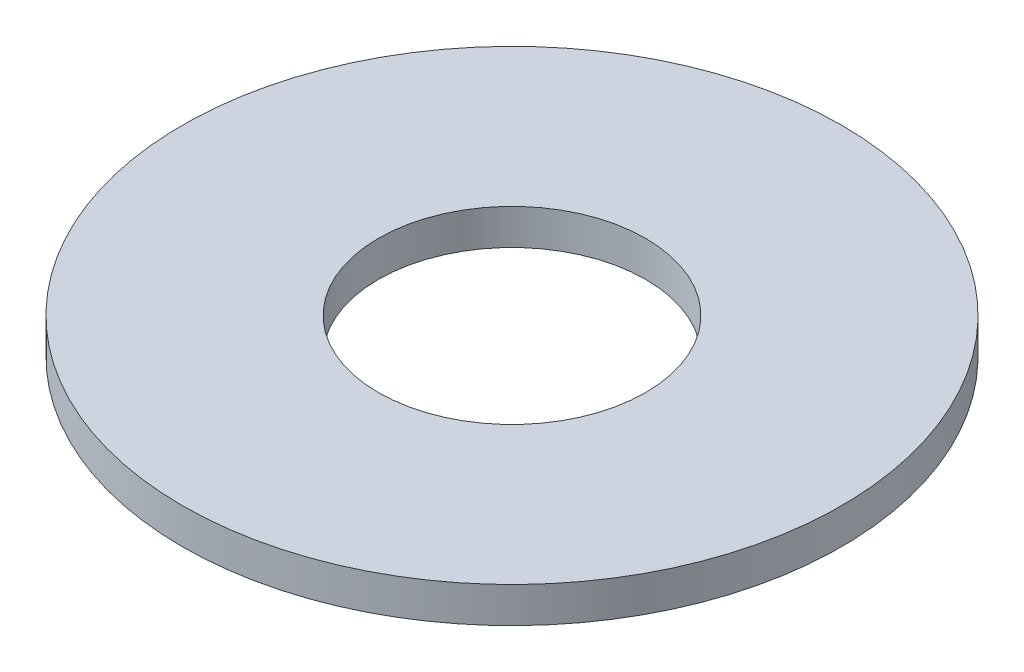
ISO-10303-21;
HEADER;
FILE_DESCRIPTION(('STEP AP214'),'2;1');
FILE_NAME('part.step','',(''),(''),'','','');
FILE_SCHEMA(('AUTOMOTIVE_DESIGN { 1 0 10303 214 1 1 1 1 }'));
ENDSEC;
DATA;
#1=APPLICATION_CONTEXT('core data for automotive mechanical design processes');
#2=APPLICATION_PROTOCOL_DEFINITION('international standard','automotive_design',2000,#1);
#3=PRODUCT_CONTEXT('',#1,'mechanical');
#4=PRODUCT('Part','Part','',(#3));
#5=PRODUCT_RELATED_PRODUCT_CATEGORY('part','',(#4));
#6=PRODUCT_DEFINITION_FORMATION('','',#4);
#7=PRODUCT_DEFINITION_CONTEXT('part definition',#1,'design');
#8=PRODUCT_DEFINITION('design','',#6,#7);
#9=PRODUCT_DEFINITION_SHAPE('','',#8);
#10=(LENGTH_UNIT() NAMED_UNIT(*) SI_UNIT(.MILLI.,.METRE.));
#11=(NAMED_UNIT(*) PLANE_ANGLE_UNIT() SI_UNIT($,.RADIAN.));
#12=(NAMED_UNIT(*) SI_UNIT($,.STERADIAN.) SOLID_ANGLE_UNIT());
#13=UNCERTAINTY_MEASURE_WITH_UNIT(LENGTH_MEASURE(1.E-05),#10,'distance_accuracy_value','');
#14=(GEOMETRIC_REPRESENTATION_CONTEXT(3) GLOBAL_UNCERTAINTY_ASSIGNED_CONTEXT((#13)) GLOBAL_UNIT_ASSIGNED_CONTEXT((#10,
#11,#12)) REPRESENTATION_CONTEXT('',''));
#15=CARTESIAN_POINT('',(0.,0.,0.));
#16=DIRECTION('',(0.,0.,1.));
#17=DIRECTION('',(1.,0.,0.));
#18=AXIS2_PLACEMENT_3D('',#15,#16,#17);
#19=CARTESIAN_POINT('',(0.,10.,0.));
#20=DIRECTION('',(0.,-1.,0.));
#21=DIRECTION('',(0.,0.,-1.));
#22=AXIS2_PLACEMENT_3D('',#19,#20,#21);
#23=CYLINDRICAL_SURFACE('',#22,92.5);
#24=CARTESIAN_POINT('',(0.,10.,0.));
#25=DIRECTION('',(0.,1.,0.));
#26=DIRECTION('',(0.,0.,1.));
#27=AXIS2_PLACEMENT_3D('',#24,#25,#26);
#28=CIRCLE('',#27,92.5);
#29=CARTESIAN_POINT('',(0.,10.,92.5));
#30=VERTEX_POINT('',#29);
#31=EDGE_CURVE('E10',#30,#30,#28,.T.);
#32=ORIENTED_EDGE('',*,*,#31,.F.);
#33=EDGE_LOOP('',(#32));
#34=FACE_BOUND('',#33,.T.);
#35=CARTESIAN_POINT('',(0.,0.,0.));
#36=DIRECTION('',(0.,1.,0.));
#37=DIRECTION('',(0.,0.,1.));
#38=AXIS2_PLACEMENT_3D('',#35,#36,#37);
#39=CIRCLE('',#38,92.5);
#40=CARTESIAN_POINT('',(0.,0.,92.5));
#41=VERTEX_POINT('',#40);
#42=EDGE_CURVE('E37',#41,#41,#39,.T.);
#43=ORIENTED_EDGE('',*,*,#42,.T.);
#44=EDGE_LOOP('',(#43));
#45=FACE_BOUND('',#44,.T.);
#46=ADVANCED_FACE('F40',(#34,#45),#23,.T.);
#47=CARTESIAN_POINT('',(0.,10.,0.));
#48=DIRECTION('',(0.,1.,0.));
#49=DIRECTION('',(0.,0.,1.));
#50=AXIS2_PLACEMENT_3D('',#47,#48,#49);
#51=PLANE('',#50);
#52=CARTESIAN_POINT('',(0.,10.,0.));
#53=DIRECTION('',(0.,1.,0.));
#54=DIRECTION('',(0.,0.,1.));
#55=AXIS2_PLACEMENT_3D('',#52,#53,#54);
#56=CIRCLE('',#55,37.5);
#57=CARTESIAN_POINT('',(0.,10.,37.5));
#58=VERTEX_POINT('',#57);
#59=EDGE_CURVE('E50',#58,#58,#56,.T.);
#60=ORIENTED_EDGE('',*,*,#59,.F.);
#61=EDGE_LOOP('',(#60));
#62=FACE_BOUND('',#61,.T.);
#63=ORIENTED_EDGE('',*,*,#31,.T.);
#64=EDGE_LOOP('',(#63));
#65=FACE_BOUND('',#64,.T.);
#66=ADVANCED_FACE('F59',(#62,#65),#51,.T.);
#67=CARTESIAN_POINT('',(0.,0.,0.));
#68=DIRECTION('',(0.,1.,0.));
#69=DIRECTION('',(0.,0.,1.));
#70=AXIS2_PLACEMENT_3D('',#67,#68,#69);
#71=PLANE('',#70);
#72=CARTESIAN_POINT('',(0.,0.,0.));
#73=DIRECTION('',(0.,1.,0.));
#74=DIRECTION('',(0.,0.,1.));
#75=AXIS2_PLACEMENT_3D('',#72,#73,#74);
#76=CIRCLE('',#75,37.5);
#77=CARTESIAN_POINT('',(0.,0.,37.5));
#78=VERTEX_POINT('',#77);
#79=EDGE_CURVE('E47',#78,#78,#76,.T.);
#80=ORIENTED_EDGE('',*,*,#79,.T.);
#81=EDGE_LOOP('',(#80));
#82=FACE_BOUND('',#81,.T.);
#83=ORIENTED_EDGE('',*,*,#42,.F.);
#84=EDGE_LOOP('',(#83));
#85=FACE_BOUND('',#84,.T.);
#86=ADVANCED_FACE('F58',(#82,#85),#71,.F.);
#87=CARTESIAN_POINT('',(0.,10.,0.));
#88=DIRECTION('',(0.,-1.,0.));
#89=DIRECTION('',(0.,0.,-1.));
#90=AXIS2_PLACEMENT_3D('',#87,#88,#89);
#91=CYLINDRICAL_SURFACE('',#90,37.5);
#92=ORIENTED_EDGE('',*,*,#59,.T.);
#93=EDGE_LOOP('',(#92));
#94=FACE_BOUND('',#93,.T.);
#95=ORIENTED_EDGE('',*,*,#79,.F.);
#96=EDGE_LOOP('',(#95));
#97=FACE_BOUND('',#96,.T.);
#98=ADVANCED_FACE('F54',(#94,#97),#91,.F.);
#99=CLOSED_SHELL('',(#46,#66,#86,#98));
#100=MANIFOLD_SOLID_BREP('B2',#99);
#101=ADVANCED_BREP_SHAPE_REPRESENTATION('',(#18,#100),#14);
#102=SHAPE_DEFINITION_REPRESENTATION(#9,#101);
ENDSEC;
END-ISO-10303-21;
